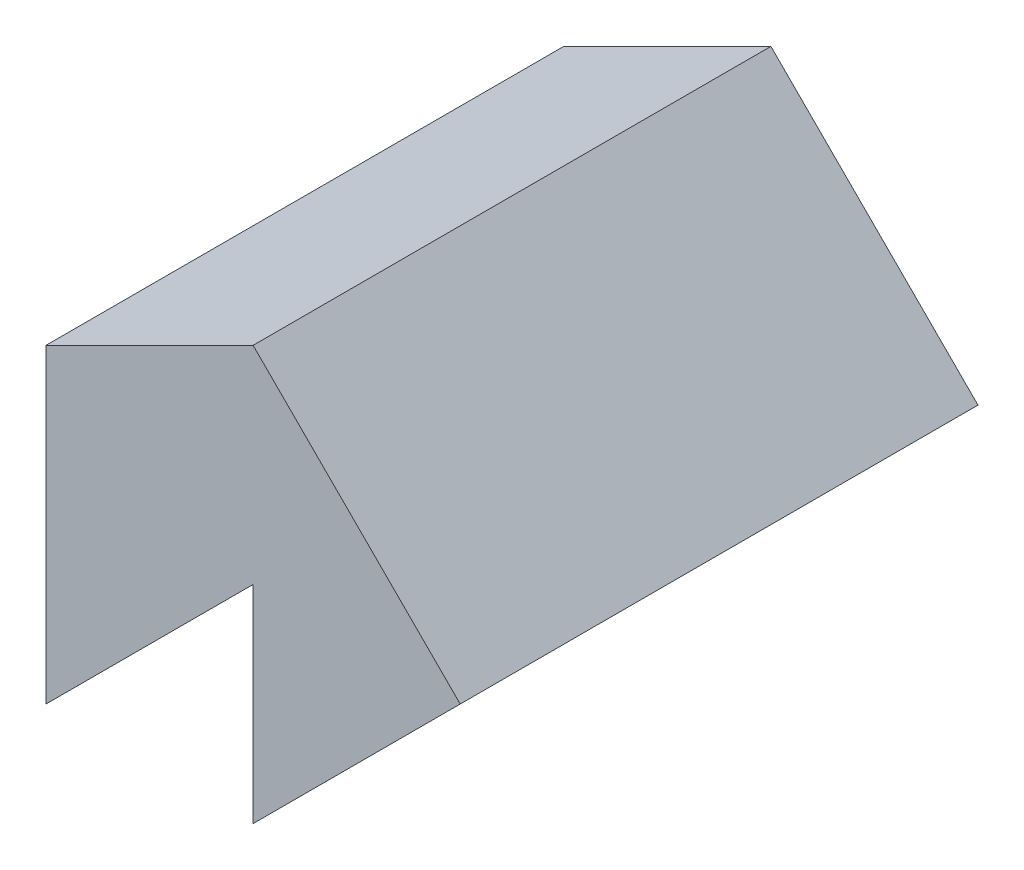
ISO-10303-21;
HEADER;
FILE_DESCRIPTION(('STEP AP214'),'2;1');
FILE_NAME('part.step','',(''),(''),'','','');
FILE_SCHEMA(('AUTOMOTIVE_DESIGN { 1 0 10303 214 1 1 1 1 }'));
ENDSEC;
DATA;
#1=APPLICATION_CONTEXT('core data for automotive mechanical design processes');
#2=APPLICATION_PROTOCOL_DEFINITION('international standard','automotive_design',2000,#1);
#3=PRODUCT_CONTEXT('',#1,'mechanical');
#4=PRODUCT('Part','Part','',(#3));
#5=PRODUCT_RELATED_PRODUCT_CATEGORY('part','',(#4));
#6=PRODUCT_DEFINITION_FORMATION('','',#4);
#7=PRODUCT_DEFINITION_CONTEXT('part definition',#1,'design');
#8=PRODUCT_DEFINITION('design','',#6,#7);
#9=PRODUCT_DEFINITION_SHAPE('','',#8);
#10=(LENGTH_UNIT() NAMED_UNIT(*) SI_UNIT(.MILLI.,.METRE.));
#11=(NAMED_UNIT(*) PLANE_ANGLE_UNIT() SI_UNIT($,.RADIAN.));
#12=(NAMED_UNIT(*) SI_UNIT($,.STERADIAN.) SOLID_ANGLE_UNIT());
#13=UNCERTAINTY_MEASURE_WITH_UNIT(LENGTH_MEASURE(1.E-05),#10,'distance_accuracy_value','');
#14=(GEOMETRIC_REPRESENTATION_CONTEXT(3) GLOBAL_UNCERTAINTY_ASSIGNED_CONTEXT((#13)) GLOBAL_UNIT_ASSIGNED_CONTEXT((#10,
#11,#12)) REPRESENTATION_CONTEXT('',''));
#15=CARTESIAN_POINT('',(0.,0.,0.));
#16=DIRECTION('',(0.,0.,1.));
#17=DIRECTION('',(1.,0.,0.));
#18=AXIS2_PLACEMENT_3D('',#15,#16,#17);
#19=CARTESIAN_POINT('',(-10.,-10.,25.));
#20=DIRECTION('',(1.,0.,0.));
#21=DIRECTION('',(0.,0.,-1.));
#22=AXIS2_PLACEMENT_3D('',#19,#20,#21);
#23=PLANE('',#22);
#24=DIRECTION('',(0.,-1.,0.));
#25=VECTOR('',#24,1.);
#26=CARTESIAN_POINT('',(-10.,-10.,0.));
#27=LINE('',#26,#25);
#28=CARTESIAN_POINT('',(-10.,5.,0.));
#29=VERTEX_POINT('',#28);
#30=CARTESIAN_POINT('',(-10.,-10.,0.));
#31=VERTEX_POINT('',#30);
#32=EDGE_CURVE('E117',#29,#31,#27,.T.);
#33=ORIENTED_EDGE('',*,*,#32,.T.);
#34=DIRECTION('',(0.,0.,-1.));
#35=VECTOR('',#34,1.);
#36=CARTESIAN_POINT('',(-10.,-10.,25.));
#37=LINE('',#36,#35);
#38=CARTESIAN_POINT('',(-10.,-10.,25.));
#39=VERTEX_POINT('',#38);
#40=EDGE_CURVE('E11',#39,#31,#37,.T.);
#41=ORIENTED_EDGE('',*,*,#40,.F.);
#42=DIRECTION('',(0.,-1.,0.));
#43=VECTOR('',#42,1.);
#44=CARTESIAN_POINT('',(-10.,-10.,25.));
#45=LINE('',#44,#43);
#46=CARTESIAN_POINT('',(-10.,5.,25.));
#47=VERTEX_POINT('',#46);
#48=EDGE_CURVE('E127',#47,#39,#45,.T.);
#49=ORIENTED_EDGE('',*,*,#48,.F.);
#50=DIRECTION('',(0.,0.,-1.));
#51=VECTOR('',#50,1.);
#52=CARTESIAN_POINT('',(-10.,5.,25.));
#53=LINE('',#52,#51);
#54=EDGE_CURVE('E113',#47,#29,#53,.T.);
#55=ORIENTED_EDGE('',*,*,#54,.T.);
#56=EDGE_LOOP('',(#33,#41,#49,#55));
#57=FACE_BOUND('',#56,.T.);
#58=ADVANCED_FACE('F33',(#57),#23,.F.);
#59=CARTESIAN_POINT('',(0.,0.,25.));
#60=DIRECTION('',(-0.707106781186547,0.707106781186548,0.));
#61=DIRECTION('',(-0.707106781186548,-0.707106781186547,0.));
#62=AXIS2_PLACEMENT_3D('',#59,#60,#61);
#63=PLANE('',#62);
#64=DIRECTION('',(0.707106781186548,0.707106781186547,0.));
#65=VECTOR('',#64,1.);
#66=CARTESIAN_POINT('',(0.,0.,0.));
#67=LINE('',#66,#65);
#68=CARTESIAN_POINT('',(0.,0.,0.));
#69=VERTEX_POINT('',#68);
#70=EDGE_CURVE('E120',#31,#69,#67,.T.);
#71=ORIENTED_EDGE('',*,*,#70,.T.);
#72=DIRECTION('',(0.,0.,-1.));
#73=VECTOR('',#72,1.);
#74=CARTESIAN_POINT('',(0.,0.,25.));
#75=LINE('',#74,#73);
#76=CARTESIAN_POINT('',(0.,0.,25.));
#77=VERTEX_POINT('',#76);
#78=EDGE_CURVE('E41',#77,#69,#75,.T.);
#79=ORIENTED_EDGE('',*,*,#78,.F.);
#80=DIRECTION('',(0.707106781186548,0.707106781186547,0.));
#81=VECTOR('',#80,1.);
#82=CARTESIAN_POINT('',(0.,0.,25.));
#83=LINE('',#82,#81);
#84=EDGE_CURVE('E86',#39,#77,#83,.T.);
#85=ORIENTED_EDGE('',*,*,#84,.F.);
#86=ORIENTED_EDGE('',*,*,#40,.T.);
#87=EDGE_LOOP('',(#71,#79,#85,#86));
#88=FACE_BOUND('',#87,.T.);
#89=ADVANCED_FACE('F151',(#88),#63,.F.);
#90=CARTESIAN_POINT('',(0.,-10.,25.));
#91=DIRECTION('',(1.,0.,0.));
#92=DIRECTION('',(0.,0.,-1.));
#93=AXIS2_PLACEMENT_3D('',#90,#91,#92);
#94=PLANE('',#93);
#95=DIRECTION('',(0.,-1.,0.));
#96=VECTOR('',#95,1.);
#97=CARTESIAN_POINT('',(0.,-10.,0.));
#98=LINE('',#97,#96);
#99=CARTESIAN_POINT('',(0.,-10.,0.));
#100=VERTEX_POINT('',#99);
#101=EDGE_CURVE('E122',#69,#100,#98,.T.);
#102=ORIENTED_EDGE('',*,*,#101,.T.);
#103=DIRECTION('',(0.,0.,-1.));
#104=VECTOR('',#103,1.);
#105=CARTESIAN_POINT('',(0.,-10.,25.));
#106=LINE('',#105,#104);
#107=CARTESIAN_POINT('',(0.,-10.,25.));
#108=VERTEX_POINT('',#107);
#109=EDGE_CURVE('E108',#108,#100,#106,.T.);
#110=ORIENTED_EDGE('',*,*,#109,.F.);
#111=DIRECTION('',(0.,-1.,0.));
#112=VECTOR('',#111,1.);
#113=CARTESIAN_POINT('',(0.,-10.,25.));
#114=LINE('',#113,#112);
#115=EDGE_CURVE('E99',#77,#108,#114,.T.);
#116=ORIENTED_EDGE('',*,*,#115,.F.);
#117=ORIENTED_EDGE('',*,*,#78,.T.);
#118=EDGE_LOOP('',(#102,#110,#116,#117));
#119=FACE_BOUND('',#118,.T.);
#120=ADVANCED_FACE('F133',(#119),#94,.F.);
#121=CARTESIAN_POINT('',(10.,0.,25.));
#122=DIRECTION('',(-0.707106781186548,0.707106781186548,0.));
#123=DIRECTION('',(-0.707106781186548,-0.707106781186548,0.));
#124=AXIS2_PLACEMENT_3D('',#121,#122,#123);
#125=PLANE('',#124);
#126=DIRECTION('',(0.707106781186548,0.707106781186548,0.));
#127=VECTOR('',#126,1.);
#128=CARTESIAN_POINT('',(10.,0.,0.));
#129=LINE('',#128,#127);
#130=CARTESIAN_POINT('',(10.,0.,0.));
#131=VERTEX_POINT('',#130);
#132=EDGE_CURVE('E107',#100,#131,#129,.T.);
#133=ORIENTED_EDGE('',*,*,#132,.T.);
#134=DIRECTION('',(0.,0.,-1.));
#135=VECTOR('',#134,1.);
#136=CARTESIAN_POINT('',(10.,0.,25.));
#137=LINE('',#136,#135);
#138=CARTESIAN_POINT('',(10.,0.,25.));
#139=VERTEX_POINT('',#138);
#140=EDGE_CURVE('E104',#139,#131,#137,.T.);
#141=ORIENTED_EDGE('',*,*,#140,.F.);
#142=DIRECTION('',(0.707106781186548,0.707106781186548,0.));
#143=VECTOR('',#142,1.);
#144=CARTESIAN_POINT('',(10.,0.,25.));
#145=LINE('',#144,#143);
#146=EDGE_CURVE('E93',#108,#139,#145,.T.);
#147=ORIENTED_EDGE('',*,*,#146,.F.);
#148=ORIENTED_EDGE('',*,*,#109,.T.);
#149=EDGE_LOOP('',(#133,#141,#147,#148));
#150=FACE_BOUND('',#149,.T.);
#151=ADVANCED_FACE('F105',(#150),#125,.F.);
#152=CARTESIAN_POINT('',(0.,10.,25.));
#153=DIRECTION('',(-0.707106781186548,-0.707106781186547,0.));
#154=DIRECTION('',(0.707106781186547,-0.707106781186548,0.));
#155=AXIS2_PLACEMENT_3D('',#152,#153,#154);
#156=PLANE('',#155);
#157=DIRECTION('',(-0.707106781186547,0.707106781186548,0.));
#158=VECTOR('',#157,1.);
#159=CARTESIAN_POINT('',(0.,10.,0.));
#160=LINE('',#159,#158);
#161=CARTESIAN_POINT('',(0.,10.,0.));
#162=VERTEX_POINT('',#161);
#163=EDGE_CURVE('E72',#131,#162,#160,.T.);
#164=ORIENTED_EDGE('',*,*,#163,.T.);
#165=DIRECTION('',(0.,0.,-1.));
#166=VECTOR('',#165,1.);
#167=CARTESIAN_POINT('',(0.,10.,25.));
#168=LINE('',#167,#166);
#169=CARTESIAN_POINT('',(0.,10.,25.));
#170=VERTEX_POINT('',#169);
#171=EDGE_CURVE('E109',#170,#162,#168,.T.);
#172=ORIENTED_EDGE('',*,*,#171,.F.);
#173=DIRECTION('',(-0.707106781186547,0.707106781186548,0.));
#174=VECTOR('',#173,1.);
#175=CARTESIAN_POINT('',(0.,10.,25.));
#176=LINE('',#175,#174);
#177=EDGE_CURVE('E97',#139,#170,#176,.T.);
#178=ORIENTED_EDGE('',*,*,#177,.F.);
#179=ORIENTED_EDGE('',*,*,#140,.T.);
#180=EDGE_LOOP('',(#164,#172,#178,#179));
#181=FACE_BOUND('',#180,.T.);
#182=ADVANCED_FACE('F111',(#181),#156,.F.);
#183=CARTESIAN_POINT('',(-10.,5.,25.));
#184=DIRECTION('',(0.447213595499958,-0.894427190999916,0.));
#185=DIRECTION('',(0.894427190999916,0.447213595499958,0.));
#186=AXIS2_PLACEMENT_3D('',#183,#184,#185);
#187=PLANE('',#186);
#188=DIRECTION('',(-0.894427190999916,-0.447213595499958,0.));
#189=VECTOR('',#188,1.);
#190=CARTESIAN_POINT('',(-10.,5.,0.));
#191=LINE('',#190,#189);
#192=EDGE_CURVE('E78',#162,#29,#191,.T.);
#193=ORIENTED_EDGE('',*,*,#192,.T.);
#194=ORIENTED_EDGE('',*,*,#54,.F.);
#195=DIRECTION('',(-0.894427190999916,-0.447213595499958,0.));
#196=VECTOR('',#195,1.);
#197=CARTESIAN_POINT('',(-10.,5.,25.));
#198=LINE('',#197,#196);
#199=EDGE_CURVE('E49',#170,#47,#198,.T.);
#200=ORIENTED_EDGE('',*,*,#199,.F.);
#201=ORIENTED_EDGE('',*,*,#171,.T.);
#202=EDGE_LOOP('',(#193,#194,#200,#201));
#203=FACE_BOUND('',#202,.T.);
#204=ADVANCED_FACE('F140',(#203),#187,.F.);
#205=CARTESIAN_POINT('',(0.,0.,25.));
#206=DIRECTION('',(0.,0.,-1.));
#207=DIRECTION('',(-1.,0.,0.));
#208=AXIS2_PLACEMENT_3D('',#205,#206,#207);
#209=PLANE('',#208);
#210=ORIENTED_EDGE('',*,*,#48,.T.);
#211=ORIENTED_EDGE('',*,*,#84,.T.);
#212=ORIENTED_EDGE('',*,*,#115,.T.);
#213=ORIENTED_EDGE('',*,*,#146,.T.);
#214=ORIENTED_EDGE('',*,*,#177,.T.);
#215=ORIENTED_EDGE('',*,*,#199,.T.);
#216=EDGE_LOOP('',(#210,#211,#212,#213,#214,#215));
#217=FACE_BOUND('',#216,.T.);
#218=ADVANCED_FACE('F95',(#217),#209,.F.);
#219=CARTESIAN_POINT('',(0.,0.,0.));
#220=DIRECTION('',(0.,0.,-1.));
#221=DIRECTION('',(-1.,0.,0.));
#222=AXIS2_PLACEMENT_3D('',#219,#220,#221);
#223=PLANE('',#222);
#224=ORIENTED_EDGE('',*,*,#32,.F.);
#225=ORIENTED_EDGE('',*,*,#192,.F.);
#226=ORIENTED_EDGE('',*,*,#163,.F.);
#227=ORIENTED_EDGE('',*,*,#132,.F.);
#228=ORIENTED_EDGE('',*,*,#101,.F.);
#229=ORIENTED_EDGE('',*,*,#70,.F.);
#230=EDGE_LOOP('',(#224,#225,#226,#227,#228,#229));
#231=FACE_BOUND('',#230,.T.);
#232=ADVANCED_FACE('F136',(#231),#223,.T.);
#233=CLOSED_SHELL('',(#58,#89,#120,#151,#182,#204,#218,#232));
#234=MANIFOLD_SOLID_BREP('B2',#233);
#235=ADVANCED_BREP_SHAPE_REPRESENTATION('',(#18,#234),#14);
#236=SHAPE_DEFINITION_REPRESENTATION(#9,#235);
ENDSEC;
END-ISO-10303-21;
